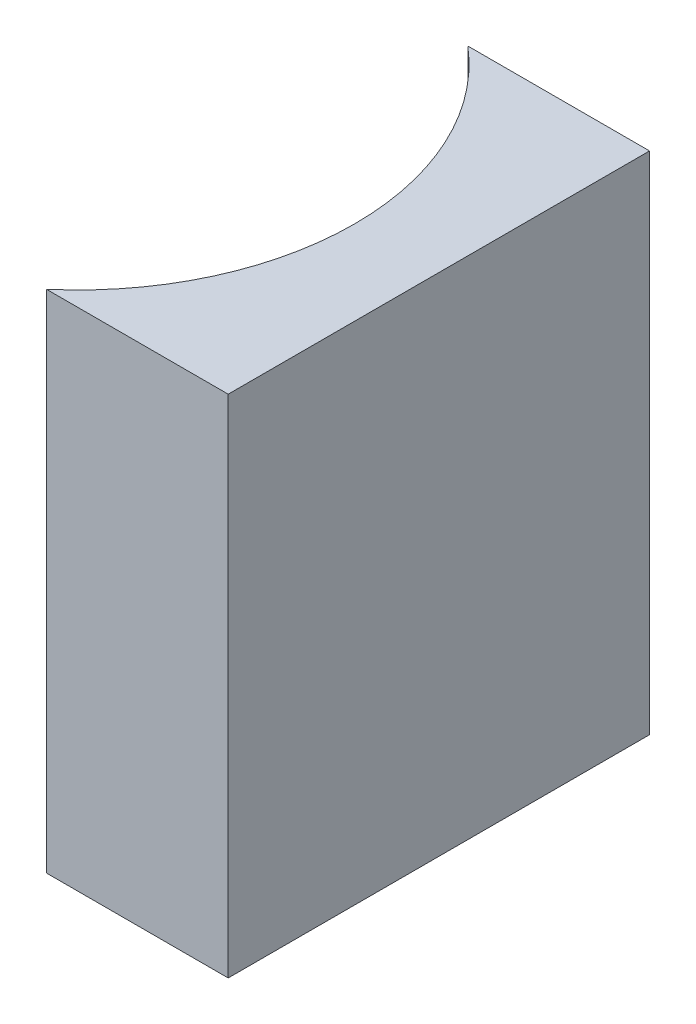
ISO-10303-21;
HEADER;
FILE_DESCRIPTION(('STEP AP214'),'2;1');
FILE_NAME('part.step','',(''),(''),'','','');
FILE_SCHEMA(('AUTOMOTIVE_DESIGN { 1 0 10303 214 1 1 1 1 }'));
ENDSEC;
DATA;
#1=APPLICATION_CONTEXT('core data for automotive mechanical design processes');
#2=APPLICATION_PROTOCOL_DEFINITION('international standard','automotive_design',2000,#1);
#3=PRODUCT_CONTEXT('',#1,'mechanical');
#4=PRODUCT('Part','Part','',(#3));
#5=PRODUCT_RELATED_PRODUCT_CATEGORY('part','',(#4));
#6=PRODUCT_DEFINITION_FORMATION('','',#4);
#7=PRODUCT_DEFINITION_CONTEXT('part definition',#1,'design');
#8=PRODUCT_DEFINITION('design','',#6,#7);
#9=PRODUCT_DEFINITION_SHAPE('','',#8);
#10=(LENGTH_UNIT() NAMED_UNIT(*) SI_UNIT(.MILLI.,.METRE.));
#11=(NAMED_UNIT(*) PLANE_ANGLE_UNIT() SI_UNIT($,.RADIAN.));
#12=(NAMED_UNIT(*) SI_UNIT($,.STERADIAN.) SOLID_ANGLE_UNIT());
#13=UNCERTAINTY_MEASURE_WITH_UNIT(LENGTH_MEASURE(1.E-05),#10,'distance_accuracy_value','');
#14=(GEOMETRIC_REPRESENTATION_CONTEXT(3) GLOBAL_UNCERTAINTY_ASSIGNED_CONTEXT((#13)) GLOBAL_UNIT_ASSIGNED_CONTEXT((#10,
#11,#12)) REPRESENTATION_CONTEXT('',''));
#15=CARTESIAN_POINT('',(0.,0.,0.));
#16=DIRECTION('',(0.,0.,1.));
#17=DIRECTION('',(1.,0.,0.));
#18=AXIS2_PLACEMENT_3D('',#15,#16,#17);
#19=CARTESIAN_POINT('',(0.,12.,0.));
#20=DIRECTION('',(0.,0.,1.));
#21=DIRECTION('',(1.,0.,0.));
#22=AXIS2_PLACEMENT_3D('',#19,#20,#21);
#23=PLANE('',#22);
#24=DIRECTION('',(-1.,0.,0.));
#25=VECTOR('',#24,1.);
#26=CARTESIAN_POINT('',(0.,0.,0.));
#27=LINE('',#26,#25);
#28=CARTESIAN_POINT('',(0.,0.,0.));
#29=VERTEX_POINT('',#28);
#30=CARTESIAN_POINT('',(-4.31340136108909,0.,0.));
#31=VERTEX_POINT('',#30);
#32=EDGE_CURVE('E98',#29,#31,#27,.T.);
#33=ORIENTED_EDGE('',*,*,#32,.T.);
#34=DIRECTION('',(0.,-1.,0.));
#35=VECTOR('',#34,1.);
#36=CARTESIAN_POINT('',(-4.31340136108909,12.,0.));
#37=LINE('',#36,#35);
#38=CARTESIAN_POINT('',(-4.31340136108909,12.,0.));
#39=VERTEX_POINT('',#38);
#40=EDGE_CURVE('E11',#39,#31,#37,.T.);
#41=ORIENTED_EDGE('',*,*,#40,.F.);
#42=DIRECTION('',(-1.,0.,0.));
#43=VECTOR('',#42,1.);
#44=CARTESIAN_POINT('',(0.,12.,0.));
#45=LINE('',#44,#43);
#46=CARTESIAN_POINT('',(0.,12.,0.));
#47=VERTEX_POINT('',#46);
#48=EDGE_CURVE('E86',#47,#39,#45,.T.);
#49=ORIENTED_EDGE('',*,*,#48,.F.);
#50=DIRECTION('',(0.,-1.,0.));
#51=VECTOR('',#50,1.);
#52=CARTESIAN_POINT('',(0.,12.,0.));
#53=LINE('',#52,#51);
#54=EDGE_CURVE('E94',#47,#29,#53,.T.);
#55=ORIENTED_EDGE('',*,*,#54,.T.);
#56=EDGE_LOOP('',(#33,#41,#49,#55));
#57=FACE_BOUND('',#56,.T.);
#58=ADVANCED_FACE('F35',(#57),#23,.F.);
#59=CARTESIAN_POINT('',(-8.56,12.,5.));
#60=DIRECTION('',(0.,-1.,0.));
#61=DIRECTION('',(0.,0.,-1.));
#62=AXIS2_PLACEMENT_3D('',#59,#60,#61);
#63=CYLINDRICAL_SURFACE('',#62,6.56);
#64=CARTESIAN_POINT('',(-8.56,0.,5.));
#65=DIRECTION('',(0.,-1.,0.));
#66=DIRECTION('',(0.,0.,1.));
#67=AXIS2_PLACEMENT_3D('',#64,#65,#66);
#68=CIRCLE('',#67,6.56);
#69=CARTESIAN_POINT('',(-4.31340136108909,0.,10.));
#70=VERTEX_POINT('',#69);
#71=EDGE_CURVE('E90',#31,#70,#68,.T.);
#72=ORIENTED_EDGE('',*,*,#71,.T.);
#73=DIRECTION('',(0.,-1.,0.));
#74=VECTOR('',#73,1.);
#75=CARTESIAN_POINT('',(-4.31340136108909,12.,10.));
#76=LINE('',#75,#74);
#77=CARTESIAN_POINT('',(-4.31340136108909,12.,10.));
#78=VERTEX_POINT('',#77);
#79=EDGE_CURVE('E43',#78,#70,#76,.T.);
#80=ORIENTED_EDGE('',*,*,#79,.F.);
#81=CARTESIAN_POINT('',(-8.56,12.,5.));
#82=DIRECTION('',(0.,-1.,0.));
#83=DIRECTION('',(0.,0.,1.));
#84=AXIS2_PLACEMENT_3D('',#81,#82,#83);
#85=CIRCLE('',#84,6.56);
#86=EDGE_CURVE('E81',#39,#78,#85,.T.);
#87=ORIENTED_EDGE('',*,*,#86,.F.);
#88=ORIENTED_EDGE('',*,*,#40,.T.);
#89=EDGE_LOOP('',(#72,#80,#87,#88));
#90=FACE_BOUND('',#89,.T.);
#91=ADVANCED_FACE('F89',(#90),#63,.F.);
#92=CARTESIAN_POINT('',(0.,12.,10.));
#93=DIRECTION('',(0.,0.,-1.));
#94=DIRECTION('',(-1.,0.,0.));
#95=AXIS2_PLACEMENT_3D('',#92,#93,#94);
#96=PLANE('',#95);
#97=DIRECTION('',(1.,0.,0.));
#98=VECTOR('',#97,1.);
#99=CARTESIAN_POINT('',(0.,0.,10.));
#100=LINE('',#99,#98);
#101=CARTESIAN_POINT('',(0.,0.,10.));
#102=VERTEX_POINT('',#101);
#103=EDGE_CURVE('E68',#70,#102,#100,.T.);
#104=ORIENTED_EDGE('',*,*,#103,.T.);
#105=DIRECTION('',(0.,-1.,0.));
#106=VECTOR('',#105,1.);
#107=CARTESIAN_POINT('',(0.,12.,10.));
#108=LINE('',#107,#106);
#109=CARTESIAN_POINT('',(0.,12.,10.));
#110=VERTEX_POINT('',#109);
#111=EDGE_CURVE('E91',#110,#102,#108,.T.);
#112=ORIENTED_EDGE('',*,*,#111,.F.);
#113=DIRECTION('',(1.,0.,0.));
#114=VECTOR('',#113,1.);
#115=CARTESIAN_POINT('',(0.,12.,10.));
#116=LINE('',#115,#114);
#117=EDGE_CURVE('E84',#78,#110,#116,.T.);
#118=ORIENTED_EDGE('',*,*,#117,.F.);
#119=ORIENTED_EDGE('',*,*,#79,.T.);
#120=EDGE_LOOP('',(#104,#112,#118,#119));
#121=FACE_BOUND('',#120,.T.);
#122=ADVANCED_FACE('F92',(#121),#96,.F.);
#123=CARTESIAN_POINT('',(0.,12.,0.));
#124=DIRECTION('',(-1.,0.,0.));
#125=DIRECTION('',(0.,0.,1.));
#126=AXIS2_PLACEMENT_3D('',#123,#124,#125);
#127=PLANE('',#126);
#128=DIRECTION('',(0.,0.,-1.));
#129=VECTOR('',#128,1.);
#130=CARTESIAN_POINT('',(0.,0.,0.));
#131=LINE('',#130,#129);
#132=EDGE_CURVE('E74',#102,#29,#131,.T.);
#133=ORIENTED_EDGE('',*,*,#132,.T.);
#134=ORIENTED_EDGE('',*,*,#54,.F.);
#135=DIRECTION('',(0.,0.,-1.));
#136=VECTOR('',#135,1.);
#137=CARTESIAN_POINT('',(0.,12.,0.));
#138=LINE('',#137,#136);
#139=EDGE_CURVE('E51',#110,#47,#138,.T.);
#140=ORIENTED_EDGE('',*,*,#139,.F.);
#141=ORIENTED_EDGE('',*,*,#111,.T.);
#142=EDGE_LOOP('',(#133,#134,#140,#141));
#143=FACE_BOUND('',#142,.T.);
#144=ADVANCED_FACE('F105',(#143),#127,.F.);
#145=CARTESIAN_POINT('',(-8.56,12.,5.));
#146=DIRECTION('',(0.,1.,0.));
#147=DIRECTION('',(0.,0.,1.));
#148=AXIS2_PLACEMENT_3D('',#145,#146,#147);
#149=PLANE('',#148);
#150=ORIENTED_EDGE('',*,*,#48,.T.);
#151=ORIENTED_EDGE('',*,*,#86,.T.);
#152=ORIENTED_EDGE('',*,*,#117,.T.);
#153=ORIENTED_EDGE('',*,*,#139,.T.);
#154=EDGE_LOOP('',(#150,#151,#152,#153));
#155=FACE_BOUND('',#154,.T.);
#156=ADVANCED_FACE('F82',(#155),#149,.T.);
#157=CARTESIAN_POINT('',(-8.56,0.,5.));
#158=DIRECTION('',(0.,1.,0.));
#159=DIRECTION('',(0.,0.,1.));
#160=AXIS2_PLACEMENT_3D('',#157,#158,#159);
#161=PLANE('',#160);
#162=ORIENTED_EDGE('',*,*,#32,.F.);
#163=ORIENTED_EDGE('',*,*,#132,.F.);
#164=ORIENTED_EDGE('',*,*,#103,.F.);
#165=ORIENTED_EDGE('',*,*,#71,.F.);
#166=EDGE_LOOP('',(#162,#163,#164,#165));
#167=FACE_BOUND('',#166,.T.);
#168=ADVANCED_FACE('F108',(#167),#161,.F.);
#169=CLOSED_SHELL('',(#58,#91,#122,#144,#156,#168));
#170=MANIFOLD_SOLID_BREP('B2',#169);
#171=ADVANCED_BREP_SHAPE_REPRESENTATION('',(#18,#170),#14);
#172=SHAPE_DEFINITION_REPRESENTATION(#9,#171);
ENDSEC;
END-ISO-10303-21;
